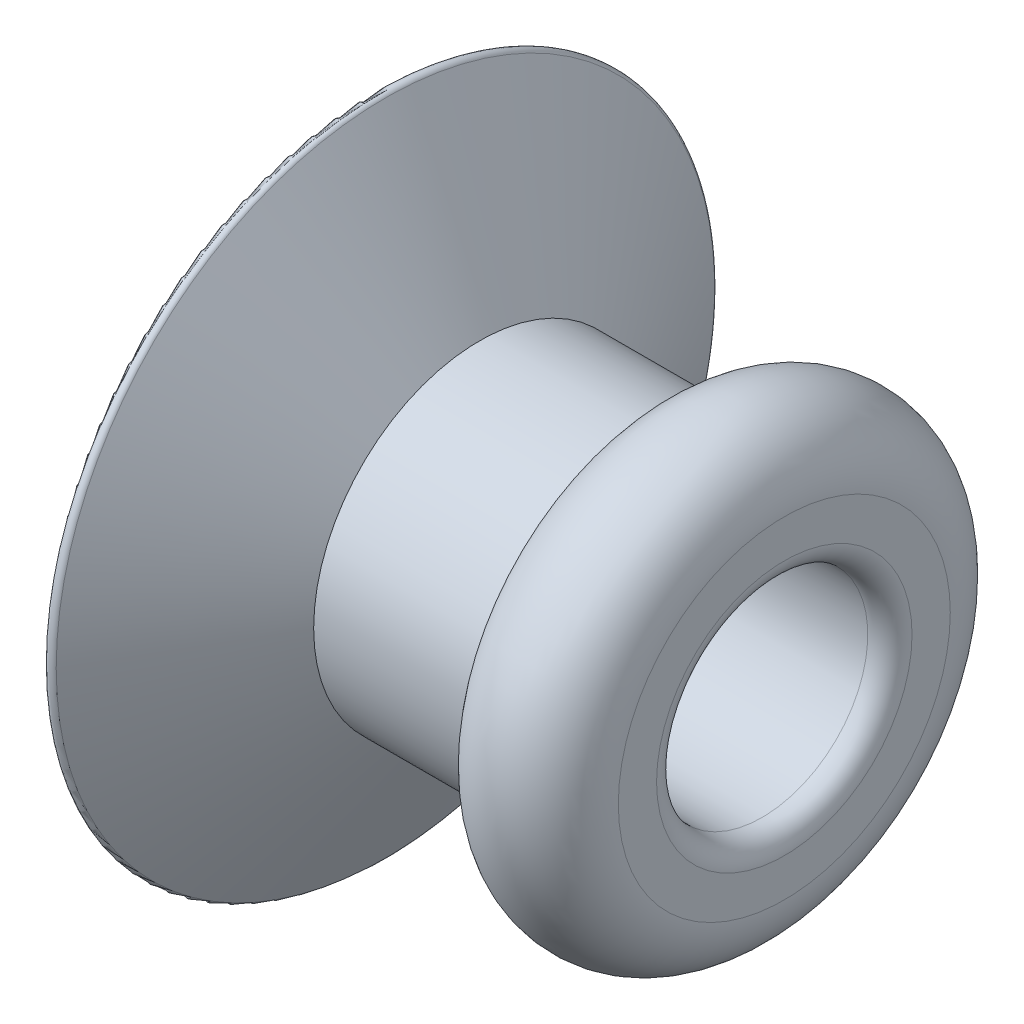
ISO-10303-21;
HEADER;
FILE_DESCRIPTION(('STEP AP214'),'2;1');
FILE_NAME('part.step','',(''),(''),'','','');
FILE_SCHEMA(('AUTOMOTIVE_DESIGN { 1 0 10303 214 1 1 1 1 }'));
ENDSEC;
DATA;
#1=APPLICATION_CONTEXT('core data for automotive mechanical design processes');
#2=APPLICATION_PROTOCOL_DEFINITION('international standard','automotive_design',2000,#1);
#3=PRODUCT_CONTEXT('',#1,'mechanical');
#4=PRODUCT('Part','Part','',(#3));
#5=PRODUCT_RELATED_PRODUCT_CATEGORY('part','',(#4));
#6=PRODUCT_DEFINITION_FORMATION('','',#4);
#7=PRODUCT_DEFINITION_CONTEXT('part definition',#1,'design');
#8=PRODUCT_DEFINITION('design','',#6,#7);
#9=PRODUCT_DEFINITION_SHAPE('','',#8);
#10=(LENGTH_UNIT() NAMED_UNIT(*) SI_UNIT(.MILLI.,.METRE.));
#11=(NAMED_UNIT(*) PLANE_ANGLE_UNIT() SI_UNIT($,.RADIAN.));
#12=(NAMED_UNIT(*) SI_UNIT($,.STERADIAN.) SOLID_ANGLE_UNIT());
#13=UNCERTAINTY_MEASURE_WITH_UNIT(LENGTH_MEASURE(1.E-05),#10,'distance_accuracy_value','');
#14=(GEOMETRIC_REPRESENTATION_CONTEXT(3) GLOBAL_UNCERTAINTY_ASSIGNED_CONTEXT((#13)) GLOBAL_UNIT_ASSIGNED_CONTEXT((#10,
#11,#12)) REPRESENTATION_CONTEXT('',''));
#15=CARTESIAN_POINT('',(0.,0.,0.));
#16=DIRECTION('',(0.,0.,1.));
#17=DIRECTION('',(1.,0.,0.));
#18=AXIS2_PLACEMENT_3D('',#15,#16,#17);
#19=CARTESIAN_POINT('',(0.05,0.,0.));
#20=DIRECTION('',(-1.,0.,0.));
#21=DIRECTION('',(0.,0.,1.));
#22=AXIS2_PLACEMENT_3D('',#19,#20,#21);
#23=TOROIDAL_SURFACE('',#22,2.95,0.0499999999999998);
#24=CARTESIAN_POINT('',(0.0933012701892218,0.,0.));
#25=DIRECTION('',(-1.,0.,0.));
#26=DIRECTION('',(0.,0.,1.));
#27=AXIS2_PLACEMENT_3D('',#24,#25,#26);
#28=CIRCLE('',#27,2.975);
#29=CARTESIAN_POINT('',(0.0933012701892218,0.,2.975));
#30=VERTEX_POINT('',#29);
#31=EDGE_CURVE('E10',#30,#30,#28,.T.);
#32=ORIENTED_EDGE('',*,*,#31,.T.);
#33=EDGE_LOOP('',(#32));
#34=FACE_BOUND('',#33,.T.);
#35=CARTESIAN_POINT('',(0.,0.,0.));
#36=DIRECTION('',(-1.,0.,0.));
#37=DIRECTION('',(0.,0.,1.));
#38=AXIS2_PLACEMENT_3D('',#35,#36,#37);
#39=CIRCLE('',#38,2.95);
#40=CARTESIAN_POINT('',(0.,0.,2.95));
#41=VERTEX_POINT('',#40);
#42=EDGE_CURVE('E70',#41,#41,#39,.T.);
#43=ORIENTED_EDGE('',*,*,#42,.F.);
#44=EDGE_LOOP('',(#43));
#45=FACE_BOUND('',#44,.T.);
#46=ADVANCED_FACE('F36',(#34,#45),#23,.T.);
#47=CARTESIAN_POINT('',(0.0933012701892218,0.,0.));
#48=DIRECTION('',(-1.,0.,0.));
#49=DIRECTION('',(0.,0.,1.));
#50=AXIS2_PLACEMENT_3D('',#47,#48,#49);
#51=CONICAL_SURFACE('',#50,2.975,1.0471975511966);
#52=CARTESIAN_POINT('',(0.944892917243914,0.,0.));
#53=DIRECTION('',(-1.,0.,0.));
#54=DIRECTION('',(0.,0.,1.));
#55=AXIS2_PLACEMENT_3D('',#52,#53,#54);
#56=CIRCLE('',#55,1.5);
#57=CARTESIAN_POINT('',(0.944892917243914,0.,1.5));
#58=VERTEX_POINT('',#57);
#59=EDGE_CURVE('E42',#58,#58,#56,.T.);
#60=ORIENTED_EDGE('',*,*,#59,.T.);
#61=EDGE_LOOP('',(#60));
#62=FACE_BOUND('',#61,.T.);
#63=ORIENTED_EDGE('',*,*,#31,.F.);
#64=EDGE_LOOP('',(#63));
#65=FACE_BOUND('',#64,.T.);
#66=ADVANCED_FACE('F78',(#62,#65),#51,.T.);
#67=CARTESIAN_POINT('',(0.,0.,0.));
#68=DIRECTION('',(-1.,0.,0.));
#69=DIRECTION('',(0.,0.,1.));
#70=AXIS2_PLACEMENT_3D('',#67,#68,#69);
#71=CYLINDRICAL_SURFACE('',#70,1.5);
#72=CARTESIAN_POINT('',(2.5,0.,0.));
#73=DIRECTION('',(-1.,0.,0.));
#74=DIRECTION('',(0.,0.,1.));
#75=AXIS2_PLACEMENT_3D('',#72,#73,#74);
#76=CIRCLE('',#75,1.5);
#77=CARTESIAN_POINT('',(2.5,0.,1.5));
#78=VERTEX_POINT('',#77);
#79=EDGE_CURVE('E47',#78,#78,#76,.T.);
#80=ORIENTED_EDGE('',*,*,#79,.T.);
#81=EDGE_LOOP('',(#80));
#82=FACE_BOUND('',#81,.T.);
#83=ORIENTED_EDGE('',*,*,#59,.F.);
#84=EDGE_LOOP('',(#83));
#85=FACE_BOUND('',#84,.T.);
#86=ADVANCED_FACE('F82',(#82,#85),#71,.T.);
#87=CARTESIAN_POINT('',(3.09903810567666,0.,0.));
#88=DIRECTION('',(-1.,0.,0.));
#89=DIRECTION('',(0.,0.,1.));
#90=AXIS2_PLACEMENT_3D('',#87,#88,#89);
#91=TOROIDAL_SURFACE('',#90,1.5,0.599038105676656);
#92=CARTESIAN_POINT('',(3.69807621135331,0.,0.));
#93=DIRECTION('',(-1.,0.,0.));
#94=DIRECTION('',(0.,0.,1.));
#95=AXIS2_PLACEMENT_3D('',#92,#93,#94);
#96=CIRCLE('',#95,1.5);
#97=CARTESIAN_POINT('',(3.69807621135331,0.,1.5));
#98=VERTEX_POINT('',#97);
#99=EDGE_CURVE('E53',#98,#98,#96,.T.);
#100=ORIENTED_EDGE('',*,*,#99,.T.);
#101=EDGE_LOOP('',(#100));
#102=FACE_BOUND('',#101,.T.);
#103=ORIENTED_EDGE('',*,*,#79,.F.);
#104=EDGE_LOOP('',(#103));
#105=FACE_BOUND('',#104,.T.);
#106=ADVANCED_FACE('F86',(#102,#105),#91,.T.);
#107=CARTESIAN_POINT('',(3.69807621135331,-1.15446581987386,0.));
#108=DIRECTION('',(1.,0.,0.));
#109=DIRECTION('',(0.,0.,-1.));
#110=AXIS2_PLACEMENT_3D('',#107,#108,#109);
#111=PLANE('',#110);
#112=CARTESIAN_POINT('',(3.69807621135331,0.,0.));
#113=DIRECTION('',(-1.,0.,0.));
#114=DIRECTION('',(0.,0.,1.));
#115=AXIS2_PLACEMENT_3D('',#112,#113,#114);
#116=CIRCLE('',#115,1.15446581987386);
#117=CARTESIAN_POINT('',(3.69807621135331,0.,1.15446581987386));
#118=VERTEX_POINT('',#117);
#119=EDGE_CURVE('E58',#118,#118,#116,.T.);
#120=ORIENTED_EDGE('',*,*,#119,.T.);
#121=EDGE_LOOP('',(#120));
#122=FACE_BOUND('',#121,.T.);
#123=ORIENTED_EDGE('',*,*,#99,.F.);
#124=EDGE_LOOP('',(#123));
#125=FACE_BOUND('',#124,.T.);
#126=ADVANCED_FACE('F93',(#122,#125),#111,.T.);
#127=CARTESIAN_POINT('',(3.49807621135331,0.,0.));
#128=DIRECTION('',(-1.,0.,0.));
#129=DIRECTION('',(0.,0.,1.));
#130=AXIS2_PLACEMENT_3D('',#127,#128,#129);
#131=TOROIDAL_SURFACE('',#130,1.15446581987386,0.2);
#132=CARTESIAN_POINT('',(3.49807621135331,0.,0.));
#133=DIRECTION('',(-1.,0.,0.));
#134=DIRECTION('',(0.,0.,1.));
#135=AXIS2_PLACEMENT_3D('',#132,#133,#134);
#136=CIRCLE('',#135,0.95446581987386);
#137=CARTESIAN_POINT('',(3.49807621135331,0.,0.95446581987386));
#138=VERTEX_POINT('',#137);
#139=EDGE_CURVE('E61',#138,#138,#136,.T.);
#140=ORIENTED_EDGE('',*,*,#139,.T.);
#141=EDGE_LOOP('',(#140));
#142=FACE_BOUND('',#141,.T.);
#143=ORIENTED_EDGE('',*,*,#119,.F.);
#144=EDGE_LOOP('',(#143));
#145=FACE_BOUND('',#144,.T.);
#146=ADVANCED_FACE('F97',(#142,#145),#131,.T.);
#147=CARTESIAN_POINT('',(0.,0.,0.));
#148=DIRECTION('',(-1.,0.,0.));
#149=DIRECTION('',(0.,0.,1.));
#150=AXIS2_PLACEMENT_3D('',#147,#148,#149);
#151=CYLINDRICAL_SURFACE('',#150,0.954465819873862);
#152=CARTESIAN_POINT('',(0.2,0.,0.));
#153=DIRECTION('',(-1.,0.,0.));
#154=DIRECTION('',(0.,0.,1.));
#155=AXIS2_PLACEMENT_3D('',#152,#153,#154);
#156=CIRCLE('',#155,0.954465819873863);
#157=CARTESIAN_POINT('',(0.2,0.,0.954465819873863));
#158=VERTEX_POINT('',#157);
#159=EDGE_CURVE('E64',#158,#158,#156,.T.);
#160=ORIENTED_EDGE('',*,*,#159,.T.);
#161=EDGE_LOOP('',(#160));
#162=FACE_BOUND('',#161,.T.);
#163=ORIENTED_EDGE('',*,*,#139,.F.);
#164=EDGE_LOOP('',(#163));
#165=FACE_BOUND('',#164,.T.);
#166=ADVANCED_FACE('F101',(#162,#165),#151,.F.);
#167=CARTESIAN_POINT('',(0.2,0.,0.));
#168=DIRECTION('',(-1.,0.,0.));
#169=DIRECTION('',(0.,0.,1.));
#170=AXIS2_PLACEMENT_3D('',#167,#168,#169);
#171=TOROIDAL_SURFACE('',#170,1.15446581987386,0.2);
#172=CARTESIAN_POINT('',(0.,0.,0.));
#173=DIRECTION('',(-1.,0.,0.));
#174=DIRECTION('',(0.,0.,1.));
#175=AXIS2_PLACEMENT_3D('',#172,#173,#174);
#176=CIRCLE('',#175,1.15446581987386);
#177=CARTESIAN_POINT('',(0.,0.,1.15446581987386));
#178=VERTEX_POINT('',#177);
#179=EDGE_CURVE('E67',#178,#178,#176,.T.);
#180=ORIENTED_EDGE('',*,*,#179,.T.);
#181=EDGE_LOOP('',(#180));
#182=FACE_BOUND('',#181,.T.);
#183=ORIENTED_EDGE('',*,*,#159,.F.);
#184=EDGE_LOOP('',(#183));
#185=FACE_BOUND('',#184,.T.);
#186=ADVANCED_FACE('F105',(#182,#185),#171,.T.);
#187=CARTESIAN_POINT('',(0.,-1.15446581987386,0.));
#188=DIRECTION('',(-1.,0.,0.));
#189=DIRECTION('',(0.,0.,1.));
#190=AXIS2_PLACEMENT_3D('',#187,#188,#189);
#191=PLANE('',#190);
#192=ORIENTED_EDGE('',*,*,#42,.T.);
#193=EDGE_LOOP('',(#192));
#194=FACE_BOUND('',#193,.T.);
#195=ORIENTED_EDGE('',*,*,#179,.F.);
#196=EDGE_LOOP('',(#195));
#197=FACE_BOUND('',#196,.T.);
#198=ADVANCED_FACE('F74',(#194,#197),#191,.T.);
#199=CLOSED_SHELL('',(#46,#66,#86,#106,#126,#146,#166,#186,#198));
#200=MANIFOLD_SOLID_BREP('B2',#199);
#201=ADVANCED_BREP_SHAPE_REPRESENTATION('',(#18,#200),#14);
#202=SHAPE_DEFINITION_REPRESENTATION(#9,#201);
ENDSEC;
END-ISO-10303-21;
